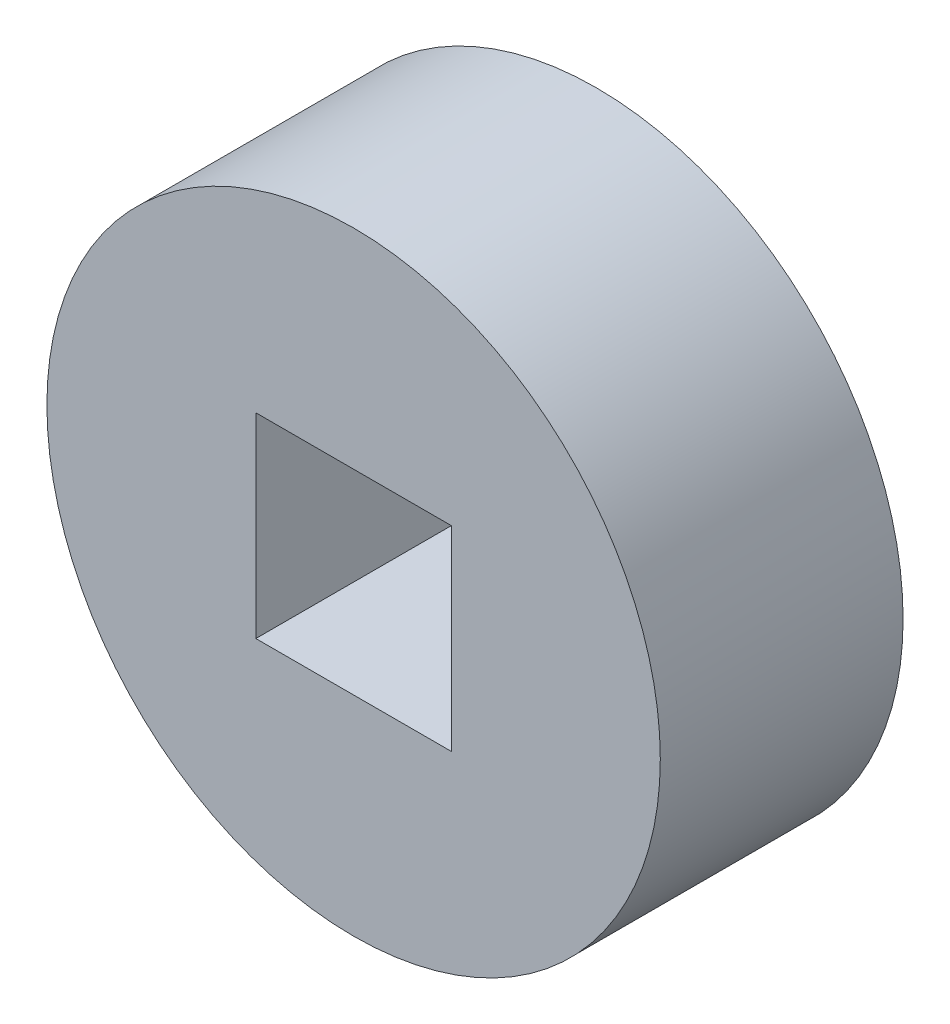
ISO-10303-21;
HEADER;
FILE_DESCRIPTION(('STEP AP214'),'2;1');
FILE_NAME('part.step','',(''),(''),'','','');
FILE_SCHEMA(('AUTOMOTIVE_DESIGN { 1 0 10303 214 1 1 1 1 }'));
ENDSEC;
DATA;
#1=APPLICATION_CONTEXT('core data for automotive mechanical design processes');
#2=APPLICATION_PROTOCOL_DEFINITION('international standard','automotive_design',2000,#1);
#3=PRODUCT_CONTEXT('',#1,'mechanical');
#4=PRODUCT('Part','Part','',(#3));
#5=PRODUCT_RELATED_PRODUCT_CATEGORY('part','',(#4));
#6=PRODUCT_DEFINITION_FORMATION('','',#4);
#7=PRODUCT_DEFINITION_CONTEXT('part definition',#1,'design');
#8=PRODUCT_DEFINITION('design','',#6,#7);
#9=PRODUCT_DEFINITION_SHAPE('','',#8);
#10=(LENGTH_UNIT() NAMED_UNIT(*) SI_UNIT(.MILLI.,.METRE.));
#11=(NAMED_UNIT(*) PLANE_ANGLE_UNIT() SI_UNIT($,.RADIAN.));
#12=(NAMED_UNIT(*) SI_UNIT($,.STERADIAN.) SOLID_ANGLE_UNIT());
#13=UNCERTAINTY_MEASURE_WITH_UNIT(LENGTH_MEASURE(1.E-05),#10,'distance_accuracy_value','');
#14=(GEOMETRIC_REPRESENTATION_CONTEXT(3) GLOBAL_UNCERTAINTY_ASSIGNED_CONTEXT((#13)) GLOBAL_UNIT_ASSIGNED_CONTEXT((#10,
#11,#12)) REPRESENTATION_CONTEXT('',''));
#15=CARTESIAN_POINT('',(0.,0.,0.));
#16=DIRECTION('',(0.,0.,1.));
#17=DIRECTION('',(1.,0.,0.));
#18=AXIS2_PLACEMENT_3D('',#15,#16,#17);
#19=CARTESIAN_POINT('',(0.,0.,1.667));
#20=DIRECTION('',(0.,0.,1.));
#21=DIRECTION('',(1.,0.,0.));
#22=AXIS2_PLACEMENT_3D('',#19,#20,#21);
#23=PLANE('',#22);
#24=CARTESIAN_POINT('',(0.,0.,1.667));
#25=DIRECTION('',(0.,0.,1.));
#26=DIRECTION('',(1.,0.,0.));
#27=AXIS2_PLACEMENT_3D('',#24,#25,#26);
#28=CIRCLE('',#27,8.00000000000001);
#29=CARTESIAN_POINT('',(8.00000000000001,0.,1.667));
#30=VERTEX_POINT('',#29);
#31=EDGE_CURVE('E11',#30,#30,#28,.T.);
#32=ORIENTED_EDGE('',*,*,#31,.F.);
#33=EDGE_LOOP('',(#32));
#34=FACE_BOUND('',#33,.T.);
#35=DIRECTION('',(0.,-1.,0.));
#36=VECTOR('',#35,1.);
#37=CARTESIAN_POINT('',(2.55,0.,1.667));
#38=LINE('',#37,#36);
#39=CARTESIAN_POINT('',(2.55,2.55,1.667));
#40=VERTEX_POINT('',#39);
#41=CARTESIAN_POINT('',(2.55,-2.55,1.667));
#42=VERTEX_POINT('',#41);
#43=EDGE_CURVE('E125',#40,#42,#38,.T.);
#44=ORIENTED_EDGE('',*,*,#43,.F.);
#45=DIRECTION('',(1.,0.,0.));
#46=VECTOR('',#45,1.);
#47=CARTESIAN_POINT('',(0.,2.55,1.667));
#48=LINE('',#47,#46);
#49=CARTESIAN_POINT('',(-2.55,2.55,1.667));
#50=VERTEX_POINT('',#49);
#51=EDGE_CURVE('E96',#50,#40,#48,.T.);
#52=ORIENTED_EDGE('',*,*,#51,.F.);
#53=DIRECTION('',(0.,1.,0.));
#54=VECTOR('',#53,1.);
#55=CARTESIAN_POINT('',(-2.55,0.,1.667));
#56=LINE('',#55,#54);
#57=CARTESIAN_POINT('',(-2.55,-2.55,1.667));
#58=VERTEX_POINT('',#57);
#59=EDGE_CURVE('E120',#58,#50,#56,.T.);
#60=ORIENTED_EDGE('',*,*,#59,.F.);
#61=DIRECTION('',(-1.,0.,0.));
#62=VECTOR('',#61,1.);
#63=CARTESIAN_POINT('',(0.,-2.55,1.667));
#64=LINE('',#63,#62);
#65=EDGE_CURVE('E98',#42,#58,#64,.T.);
#66=ORIENTED_EDGE('',*,*,#65,.F.);
#67=EDGE_LOOP('',(#44,#52,#60,#66));
#68=FACE_BOUND('',#67,.T.);
#69=ADVANCED_FACE('F39',(#34,#68),#23,.F.);
#70=CARTESIAN_POINT('',(0.,0.,8.));
#71=DIRECTION('',(0.,0.,1.));
#72=DIRECTION('',(1.,0.,0.));
#73=AXIS2_PLACEMENT_3D('',#70,#71,#72);
#74=PLANE('',#73);
#75=CARTESIAN_POINT('',(0.,0.,8.));
#76=DIRECTION('',(0.,0.,1.));
#77=DIRECTION('',(1.,0.,0.));
#78=AXIS2_PLACEMENT_3D('',#75,#76,#77);
#79=CIRCLE('',#78,8.00000000000001);
#80=CARTESIAN_POINT('',(8.00000000000001,0.,8.));
#81=VERTEX_POINT('',#80);
#82=EDGE_CURVE('E43',#81,#81,#79,.T.);
#83=ORIENTED_EDGE('',*,*,#82,.T.);
#84=EDGE_LOOP('',(#83));
#85=FACE_BOUND('',#84,.T.);
#86=DIRECTION('',(-1.,0.,0.));
#87=VECTOR('',#86,1.);
#88=CARTESIAN_POINT('',(-2.55,2.55,8.));
#89=LINE('',#88,#87);
#90=CARTESIAN_POINT('',(2.55,2.55,8.));
#91=VERTEX_POINT('',#90);
#92=CARTESIAN_POINT('',(-2.55,2.55,8.));
#93=VERTEX_POINT('',#92);
#94=EDGE_CURVE('E89',#91,#93,#89,.T.);
#95=ORIENTED_EDGE('',*,*,#94,.F.);
#96=DIRECTION('',(0.,1.,0.));
#97=VECTOR('',#96,1.);
#98=CARTESIAN_POINT('',(2.55,-2.55,8.));
#99=LINE('',#98,#97);
#100=CARTESIAN_POINT('',(2.55,-2.55,8.));
#101=VERTEX_POINT('',#100);
#102=EDGE_CURVE('E80',#101,#91,#99,.T.);
#103=ORIENTED_EDGE('',*,*,#102,.F.);
#104=DIRECTION('',(1.,0.,0.));
#105=VECTOR('',#104,1.);
#106=CARTESIAN_POINT('',(-2.55,-2.55,8.));
#107=LINE('',#106,#105);
#108=CARTESIAN_POINT('',(-2.55,-2.55,8.));
#109=VERTEX_POINT('',#108);
#110=EDGE_CURVE('E107',#109,#101,#107,.T.);
#111=ORIENTED_EDGE('',*,*,#110,.F.);
#112=DIRECTION('',(0.,-1.,0.));
#113=VECTOR('',#112,1.);
#114=CARTESIAN_POINT('',(-2.55,-2.55,8.));
#115=LINE('',#114,#113);
#116=EDGE_CURVE('E103',#93,#109,#115,.T.);
#117=ORIENTED_EDGE('',*,*,#116,.F.);
#118=EDGE_LOOP('',(#95,#103,#111,#117));
#119=FACE_BOUND('',#118,.T.);
#120=ADVANCED_FACE('F102',(#85,#119),#74,.T.);
#121=CARTESIAN_POINT('',(0.,0.,1.667));
#122=DIRECTION('',(0.,0.,1.));
#123=DIRECTION('',(1.,0.,0.));
#124=AXIS2_PLACEMENT_3D('',#121,#122,#123);
#125=CYLINDRICAL_SURFACE('',#124,8.00000000000001);
#126=ORIENTED_EDGE('',*,*,#31,.T.);
#127=EDGE_LOOP('',(#126));
#128=FACE_BOUND('',#127,.T.);
#129=ORIENTED_EDGE('',*,*,#82,.F.);
#130=EDGE_LOOP('',(#129));
#131=FACE_BOUND('',#130,.T.);
#132=ADVANCED_FACE('F41',(#128,#131),#125,.T.);
#133=CARTESIAN_POINT('',(2.55,-2.55,8.));
#134=DIRECTION('',(-1.,0.,0.));
#135=DIRECTION('',(0.,0.,1.));
#136=AXIS2_PLACEMENT_3D('',#133,#134,#135);
#137=PLANE('',#136);
#138=ORIENTED_EDGE('',*,*,#43,.T.);
#139=DIRECTION('',(0.,0.,-1.));
#140=VECTOR('',#139,1.);
#141=CARTESIAN_POINT('',(2.55,-2.55,8.));
#142=LINE('',#141,#140);
#143=EDGE_CURVE('E55',#101,#42,#142,.T.);
#144=ORIENTED_EDGE('',*,*,#143,.F.);
#145=ORIENTED_EDGE('',*,*,#102,.T.);
#146=DIRECTION('',(0.,0.,-1.));
#147=VECTOR('',#146,1.);
#148=CARTESIAN_POINT('',(2.55,2.55,8.));
#149=LINE('',#148,#147);
#150=EDGE_CURVE('E83',#91,#40,#149,.T.);
#151=ORIENTED_EDGE('',*,*,#150,.T.);
#152=EDGE_LOOP('',(#138,#144,#145,#151));
#153=FACE_BOUND('',#152,.T.);
#154=ADVANCED_FACE('F82',(#153),#137,.T.);
#155=CARTESIAN_POINT('',(-2.55,2.55,8.));
#156=DIRECTION('',(0.,-1.,0.));
#157=DIRECTION('',(0.,0.,-1.));
#158=AXIS2_PLACEMENT_3D('',#155,#156,#157);
#159=PLANE('',#158);
#160=ORIENTED_EDGE('',*,*,#51,.T.);
#161=ORIENTED_EDGE('',*,*,#150,.F.);
#162=ORIENTED_EDGE('',*,*,#94,.T.);
#163=DIRECTION('',(0.,0.,-1.));
#164=VECTOR('',#163,1.);
#165=CARTESIAN_POINT('',(-2.55,2.55,8.));
#166=LINE('',#165,#164);
#167=EDGE_CURVE('E99',#93,#50,#166,.T.);
#168=ORIENTED_EDGE('',*,*,#167,.T.);
#169=EDGE_LOOP('',(#160,#161,#162,#168));
#170=FACE_BOUND('',#169,.T.);
#171=ADVANCED_FACE('F92',(#170),#159,.T.);
#172=CARTESIAN_POINT('',(-2.55,-2.55,8.));
#173=DIRECTION('',(1.,0.,0.));
#174=DIRECTION('',(0.,0.,-1.));
#175=AXIS2_PLACEMENT_3D('',#172,#173,#174);
#176=PLANE('',#175);
#177=ORIENTED_EDGE('',*,*,#59,.T.);
#178=ORIENTED_EDGE('',*,*,#167,.F.);
#179=ORIENTED_EDGE('',*,*,#116,.T.);
#180=DIRECTION('',(0.,0.,-1.));
#181=VECTOR('',#180,1.);
#182=CARTESIAN_POINT('',(-2.55,-2.55,8.));
#183=LINE('',#182,#181);
#184=EDGE_CURVE('E60',#109,#58,#183,.T.);
#185=ORIENTED_EDGE('',*,*,#184,.T.);
#186=EDGE_LOOP('',(#177,#178,#179,#185));
#187=FACE_BOUND('',#186,.T.);
#188=ADVANCED_FACE('F150',(#187),#176,.T.);
#189=CARTESIAN_POINT('',(-2.55,-2.55,8.));
#190=DIRECTION('',(0.,1.,0.));
#191=DIRECTION('',(0.,0.,1.));
#192=AXIS2_PLACEMENT_3D('',#189,#190,#191);
#193=PLANE('',#192);
#194=ORIENTED_EDGE('',*,*,#65,.T.);
#195=ORIENTED_EDGE('',*,*,#184,.F.);
#196=ORIENTED_EDGE('',*,*,#110,.T.);
#197=ORIENTED_EDGE('',*,*,#143,.T.);
#198=EDGE_LOOP('',(#194,#195,#196,#197));
#199=FACE_BOUND('',#198,.T.);
#200=ADVANCED_FACE('F153',(#199),#193,.T.);
#201=CLOSED_SHELL('',(#69,#120,#132,#154,#171,#188,#200));
#202=MANIFOLD_SOLID_BREP('B2',#201);
#203=ADVANCED_BREP_SHAPE_REPRESENTATION('',(#18,#202),#14);
#204=SHAPE_DEFINITION_REPRESENTATION(#9,#203);
ENDSEC;
END-ISO-10303-21;
